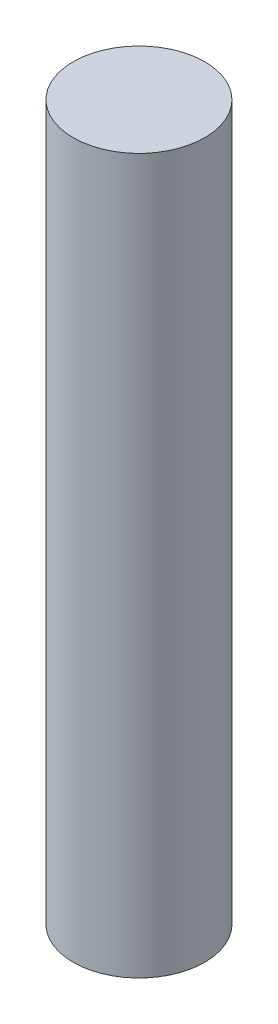
ISO-10303-21;
HEADER;
FILE_DESCRIPTION(('STEP AP214'),'2;1');
FILE_NAME('part.step','',(''),(''),'','','');
FILE_SCHEMA(('AUTOMOTIVE_DESIGN { 1 0 10303 214 1 1 1 1 }'));
ENDSEC;
DATA;
#1=APPLICATION_CONTEXT('core data for automotive mechanical design processes');
#2=APPLICATION_PROTOCOL_DEFINITION('international standard','automotive_design',2000,#1);
#3=PRODUCT_CONTEXT('',#1,'mechanical');
#4=PRODUCT('Part','Part','',(#3));
#5=PRODUCT_RELATED_PRODUCT_CATEGORY('part','',(#4));
#6=PRODUCT_DEFINITION_FORMATION('','',#4);
#7=PRODUCT_DEFINITION_CONTEXT('part definition',#1,'design');
#8=PRODUCT_DEFINITION('design','',#6,#7);
#9=PRODUCT_DEFINITION_SHAPE('','',#8);
#10=(LENGTH_UNIT() NAMED_UNIT(*) SI_UNIT(.MILLI.,.METRE.));
#11=(NAMED_UNIT(*) PLANE_ANGLE_UNIT() SI_UNIT($,.RADIAN.));
#12=(NAMED_UNIT(*) SI_UNIT($,.STERADIAN.) SOLID_ANGLE_UNIT());
#13=UNCERTAINTY_MEASURE_WITH_UNIT(LENGTH_MEASURE(1.E-05),#10,'distance_accuracy_value','');
#14=(GEOMETRIC_REPRESENTATION_CONTEXT(3) GLOBAL_UNCERTAINTY_ASSIGNED_CONTEXT((#13)) GLOBAL_UNIT_ASSIGNED_CONTEXT((#10,
#11,#12)) REPRESENTATION_CONTEXT('',''));
#15=CARTESIAN_POINT('',(0.,0.,0.));
#16=DIRECTION('',(0.,0.,1.));
#17=DIRECTION('',(1.,0.,0.));
#18=AXIS2_PLACEMENT_3D('',#15,#16,#17);
#19=CARTESIAN_POINT('',(0.,482.6,0.));
#20=DIRECTION('',(0.,-1.,0.));
#21=DIRECTION('',(0.,0.,-1.));
#22=AXIS2_PLACEMENT_3D('',#19,#20,#21);
#23=CYLINDRICAL_SURFACE('',#22,44.45);
#24=CARTESIAN_POINT('',(0.,482.6,0.));
#25=DIRECTION('',(0.,1.,0.));
#26=DIRECTION('',(0.,0.,1.));
#27=AXIS2_PLACEMENT_3D('',#24,#25,#26);
#28=CIRCLE('',#27,44.45);
#29=CARTESIAN_POINT('',(0.,482.6,44.45));
#30=VERTEX_POINT('',#29);
#31=EDGE_CURVE('E10',#30,#30,#28,.T.);
#32=ORIENTED_EDGE('',*,*,#31,.F.);
#33=EDGE_LOOP('',(#32));
#34=FACE_BOUND('',#33,.T.);
#35=CARTESIAN_POINT('',(0.,0.,0.));
#36=DIRECTION('',(0.,1.,0.));
#37=DIRECTION('',(0.,0.,1.));
#38=AXIS2_PLACEMENT_3D('',#35,#36,#37);
#39=CIRCLE('',#38,44.45);
#40=CARTESIAN_POINT('',(0.,0.,44.45));
#41=VERTEX_POINT('',#40);
#42=EDGE_CURVE('E41',#41,#41,#39,.T.);
#43=ORIENTED_EDGE('',*,*,#42,.T.);
#44=EDGE_LOOP('',(#43));
#45=FACE_BOUND('',#44,.T.);
#46=ADVANCED_FACE('F38',(#34,#45),#23,.T.);
#47=CARTESIAN_POINT('',(0.,482.6,0.));
#48=DIRECTION('',(0.,1.,0.));
#49=DIRECTION('',(0.,0.,1.));
#50=AXIS2_PLACEMENT_3D('',#47,#48,#49);
#51=PLANE('',#50);
#52=ORIENTED_EDGE('',*,*,#31,.T.);
#53=EDGE_LOOP('',(#52));
#54=FACE_BOUND('',#53,.T.);
#55=ADVANCED_FACE('F53',(#54),#51,.T.);
#56=CARTESIAN_POINT('',(0.,0.,0.));
#57=DIRECTION('',(0.,1.,0.));
#58=DIRECTION('',(0.,0.,1.));
#59=AXIS2_PLACEMENT_3D('',#56,#57,#58);
#60=PLANE('',#59);
#61=ORIENTED_EDGE('',*,*,#42,.F.);
#62=EDGE_LOOP('',(#61));
#63=FACE_BOUND('',#62,.T.);
#64=ADVANCED_FACE('F51',(#63),#60,.F.);
#65=CLOSED_SHELL('',(#46,#55,#64));
#66=MANIFOLD_SOLID_BREP('B2',#65);
#67=ADVANCED_BREP_SHAPE_REPRESENTATION('',(#18,#66),#14);
#68=SHAPE_DEFINITION_REPRESENTATION(#9,#67);
ENDSEC;
END-ISO-10303-21;
